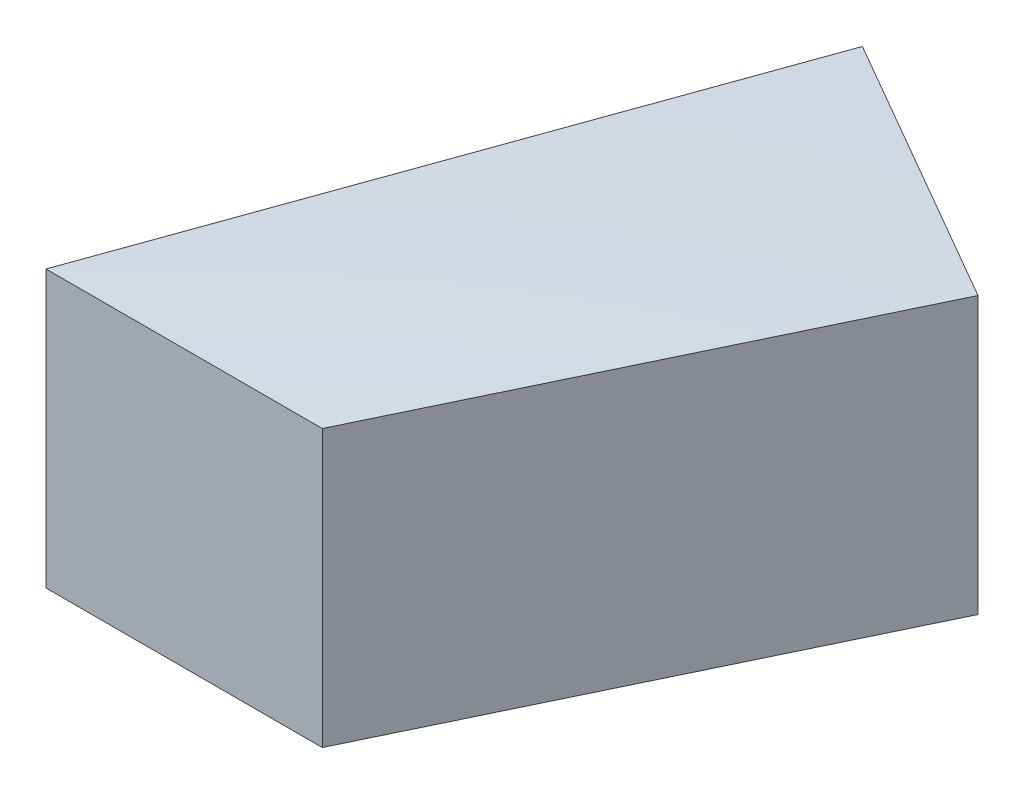
ISO-10303-21;
HEADER;
FILE_DESCRIPTION(('STEP AP214'),'2;1');
FILE_NAME('part.step','',(''),(''),'','','');
FILE_SCHEMA(('AUTOMOTIVE_DESIGN { 1 0 10303 214 1 1 1 1 }'));
ENDSEC;
DATA;
#1=APPLICATION_CONTEXT('core data for automotive mechanical design processes');
#2=APPLICATION_PROTOCOL_DEFINITION('international standard','automotive_design',2000,#1);
#3=PRODUCT_CONTEXT('',#1,'mechanical');
#4=PRODUCT('Part','Part','',(#3));
#5=PRODUCT_RELATED_PRODUCT_CATEGORY('part','',(#4));
#6=PRODUCT_DEFINITION_FORMATION('','',#4);
#7=PRODUCT_DEFINITION_CONTEXT('part definition',#1,'design');
#8=PRODUCT_DEFINITION('design','',#6,#7);
#9=PRODUCT_DEFINITION_SHAPE('','',#8);
#10=(LENGTH_UNIT() NAMED_UNIT(*) SI_UNIT(.MILLI.,.METRE.));
#11=(NAMED_UNIT(*) PLANE_ANGLE_UNIT() SI_UNIT($,.RADIAN.));
#12=(NAMED_UNIT(*) SI_UNIT($,.STERADIAN.) SOLID_ANGLE_UNIT());
#13=UNCERTAINTY_MEASURE_WITH_UNIT(LENGTH_MEASURE(1.E-05),#10,'distance_accuracy_value','');
#14=(GEOMETRIC_REPRESENTATION_CONTEXT(3) GLOBAL_UNCERTAINTY_ASSIGNED_CONTEXT((#13)) GLOBAL_UNIT_ASSIGNED_CONTEXT((#10,
#11,#12)) REPRESENTATION_CONTEXT('',''));
#15=CARTESIAN_POINT('',(0.,0.,0.));
#16=DIRECTION('',(0.,0.,1.));
#17=DIRECTION('',(1.,0.,0.));
#18=AXIS2_PLACEMENT_3D('',#15,#16,#17);
#19=CARTESIAN_POINT('',(0.,0.,0.));
#20=DIRECTION('',(0.,0.,1.));
#21=DIRECTION('',(1.,0.,0.));
#22=AXIS2_PLACEMENT_3D('',#19,#20,#21);
#23=PLANE('',#22);
#24=DIRECTION('',(0.,1.,0.));
#25=VECTOR('',#24,1.);
#26=CARTESIAN_POINT('',(350.,350.,0.));
#27=LINE('',#26,#25);
#28=CARTESIAN_POINT('',(350.,-350.,0.));
#29=VERTEX_POINT('',#28);
#30=CARTESIAN_POINT('',(350.,350.,0.));
#31=VERTEX_POINT('',#30);
#32=EDGE_CURVE('E181',#29,#31,#27,.T.);
#33=ORIENTED_EDGE('',*,*,#32,.T.);
#34=DIRECTION('',(-1.,0.,0.));
#35=VECTOR('',#34,1.);
#36=CARTESIAN_POINT('',(-350.,350.,0.));
#37=LINE('',#36,#35);
#38=CARTESIAN_POINT('',(-350.,350.,0.));
#39=VERTEX_POINT('',#38);
#40=EDGE_CURVE('E89',#31,#39,#37,.T.);
#41=ORIENTED_EDGE('',*,*,#40,.T.);
#42=DIRECTION('',(0.,-1.,0.));
#43=VECTOR('',#42,1.);
#44=CARTESIAN_POINT('',(-350.,350.,0.));
#45=LINE('',#44,#43);
#46=CARTESIAN_POINT('',(-350.,-350.,0.));
#47=VERTEX_POINT('',#46);
#48=EDGE_CURVE('E126',#39,#47,#45,.T.);
#49=ORIENTED_EDGE('',*,*,#48,.T.);
#50=DIRECTION('',(1.,0.,0.));
#51=VECTOR('',#50,1.);
#52=CARTESIAN_POINT('',(-350.,-350.,0.));
#53=LINE('',#52,#51);
#54=EDGE_CURVE('E170',#47,#29,#53,.T.);
#55=ORIENTED_EDGE('',*,*,#54,.T.);
#56=EDGE_LOOP('',(#33,#41,#49,#55));
#57=FACE_BOUND('',#56,.T.);
#58=ADVANCED_FACE('F53',(#57),#23,.T.);
#59=CARTESIAN_POINT('',(662.500000000001,0.,-1147.48366001438));
#60=DIRECTION('',(0.500000000000001,0.,-0.866025403784438));
#61=DIRECTION('',(-0.866025403784438,0.,-0.500000000000001));
#62=AXIS2_PLACEMENT_3D('',#59,#60,#61);
#63=PLANE('',#62);
#64=DIRECTION('',(-0.866025403784438,0.,-0.500000000000001));
#65=VECTOR('',#64,1.);
#66=CARTESIAN_POINT('',(1138.81397208144,600.,-872.48366001438));
#67=LINE('',#66,#65);
#68=CARTESIAN_POINT('',(1138.81397208144,600.,-872.48366001438));
#69=VERTEX_POINT('',#68);
#70=CARTESIAN_POINT('',(445.993649053891,600.,-1272.48366001438));
#71=VERTEX_POINT('',#70);
#72=EDGE_CURVE('E107',#69,#71,#67,.T.);
#73=ORIENTED_EDGE('',*,*,#72,.F.);
#74=DIRECTION('',(0.,1.,0.));
#75=VECTOR('',#74,1.);
#76=CARTESIAN_POINT('',(1138.81397208144,-99.9999999999999,-872.483660014379));
#77=LINE('',#76,#75);
#78=CARTESIAN_POINT('',(1138.81397208144,-99.9999999999999,-872.483660014379));
#79=VERTEX_POINT('',#78);
#80=EDGE_CURVE('E13',#79,#69,#77,.T.);
#81=ORIENTED_EDGE('',*,*,#80,.F.);
#82=DIRECTION('',(0.866025403784438,0.,0.500000000000001));
#83=VECTOR('',#82,1.);
#84=CARTESIAN_POINT('',(1138.81397208144,-99.9999999999999,-872.483660014379));
#85=LINE('',#84,#83);
#86=CARTESIAN_POINT('',(445.993649053892,-100.,-1272.48366001438));
#87=VERTEX_POINT('',#86);
#88=EDGE_CURVE('E64',#87,#79,#85,.T.);
#89=ORIENTED_EDGE('',*,*,#88,.F.);
#90=DIRECTION('',(0.,-1.,0.));
#91=VECTOR('',#90,1.);
#92=CARTESIAN_POINT('',(445.993649053892,-100.,-1272.48366001438));
#93=LINE('',#92,#91);
#94=EDGE_CURVE('E104',#71,#87,#93,.T.);
#95=ORIENTED_EDGE('',*,*,#94,.F.);
#96=EDGE_LOOP('',(#73,#81,#89,#95));
#97=FACE_BOUND('',#96,.T.);
#98=ADVANCED_FACE('F106',(#97),#63,.T.);
#99=CARTESIAN_POINT('',(445.993649053892,-100.,-1272.48366001438));
#100=CARTESIAN_POINT('',(180.662432702595,-183.333333333333,-848.322440009587));
#101=CARTESIAN_POINT('',(-84.6687836487026,-266.666666666667,-424.161220004793));
#102=CARTESIAN_POINT('',(-350.,-350.,0.));
#103=CARTESIAN_POINT('',(503.728675972854,-100.,-1239.15032668105));
#104=CARTESIAN_POINT('',(238.596895093014,-183.333333333333,-826.100217787364));
#105=CARTESIAN_POINT('',(-26.5348857868262,-266.666666666667,-413.050108893682));
#106=CARTESIAN_POINT('',(-291.666666666667,-350.,0.));
#107=CARTESIAN_POINT('',(619.19872981078,-100.,-1172.48366001438));
#108=CARTESIAN_POINT('',(354.465819873853,-183.333333333334,-781.65577334292));
#109=CARTESIAN_POINT('',(89.7329099369267,-266.666666666667,-390.82788667146));
#110=CARTESIAN_POINT('',(-175.,-350.,0.));
#111=CARTESIAN_POINT('',(792.403810567667,-100.,-1072.48366001438));
#112=CARTESIAN_POINT('',(528.269207045111,-183.333333333333,-714.989106676254));
#113=CARTESIAN_POINT('',(264.134603522556,-266.666666666667,-357.494553338127));
#114=CARTESIAN_POINT('',(0.,-350.,0.));
#115=CARTESIAN_POINT('',(965.608891324554,-100.,-972.483660014379));
#116=CARTESIAN_POINT('',(702.07259421637,-183.333333333333,-648.322440009586));
#117=CARTESIAN_POINT('',(438.536297108185,-266.666666666667,-324.161220004793));
#118=CARTESIAN_POINT('',(175.,-350.,0.));
#119=CARTESIAN_POINT('',(1081.07894516248,-100.,-905.816993347713));
#120=CARTESIAN_POINT('',(817.941518997209,-183.333333333333,-603.877995565142));
#121=CARTESIAN_POINT('',(554.804092831938,-266.666666666667,-301.938997782571));
#122=CARTESIAN_POINT('',(291.666666666667,-350.,0.));
#123=CARTESIAN_POINT('',(1138.81397208144,-99.9999999999999,-872.483660014379));
#124=CARTESIAN_POINT('',(875.875981387628,-183.333333333333,-581.65577334292));
#125=CARTESIAN_POINT('',(612.937990693814,-266.666666666667,-290.82788667146));
#126=CARTESIAN_POINT('',(350.,-350.,0.));
#127=B_SPLINE_SURFACE_WITH_KNOTS('',3,3,((#99,#100,#101,#102),(#103,#104,#105,#106),(#107,#108,
#109,#110),(#111,#112,#113,#114),(#115,#116,#117,#118),(#119,#120,#121,#122),(#123,#124,#125,
#126)),.UNSPECIFIED.,.F.,.F.,.F.,(4,1,1,1,4),(4,4),(0.659340659340659,0.744505494505495,
0.82967032967033,0.914835164835165,1.),(0.,1.),.UNSPECIFIED.);
#128=CARTESIAN_POINT('',(1138.81397208144,-99.9999999999999,-872.483660014379));
#129=CARTESIAN_POINT('',(875.875981387628,-183.333333333333,-581.65577334292));
#130=CARTESIAN_POINT('',(612.937990693814,-266.666666666667,-290.82788667146));
#131=CARTESIAN_POINT('',(350.,-350.,0.));
#132=B_SPLINE_CURVE_WITH_KNOTS('',3,(#128,#129,#130,#131),.UNSPECIFIED.,.F.,.F.,(4,4),(0.,1.),.UNSPECIFIED.);
#133=EDGE_CURVE('E121',#79,#29,#132,.T.);
#134=DIRECTION('',(-0.523123269933759,-0.16429882027185,0.836270256622277));
#135=VECTOR('',#134,1.);
#136=CARTESIAN_POINT('',(47.996824526946,-225.,-636.24183000719));
#137=LINE('',#136,#135);
#138=EDGE_CURVE('E128',#87,#47,#137,.T.);
#139=ORIENTED_EDGE('',*,*,#88,.T.);
#140=ORIENTED_EDGE('',*,*,#133,.T.);
#141=ORIENTED_EDGE('',*,*,#54,.F.);
#142=ORIENTED_EDGE('',*,*,#138,.F.);
#143=EDGE_LOOP('',(#139,#140,#141,#142));
#144=FACE_BOUND('',#143,.T.);
#145=ADVANCED_FACE('F149',(#144),#127,.T.);
#146=CARTESIAN_POINT('',(445.993649053891,600.,-1272.48366001438));
#147=DIRECTION('',(-0.847791219505554,0.,-0.530330131266635));
#148=DIRECTION('',(0.,-1.,0.));
#149=AXIS2_PLACEMENT_3D('',#146,#147,#148);
#150=PLANE('',#149);
#151=ORIENTED_EDGE('',*,*,#94,.T.);
#152=ORIENTED_EDGE('',*,*,#138,.T.);
#153=ORIENTED_EDGE('',*,*,#48,.F.);
#154=DIRECTION('',(-0.523123269933759,-0.164298820271851,0.836270256622277));
#155=VECTOR('',#154,1.);
#156=CARTESIAN_POINT('',(47.9968245269457,475.,-636.24183000719));
#157=LINE('',#156,#155);
#158=EDGE_CURVE('E120',#71,#39,#157,.T.);
#159=ORIENTED_EDGE('',*,*,#158,.F.);
#160=EDGE_LOOP('',(#151,#152,#153,#159));
#161=FACE_BOUND('',#160,.T.);
#162=ADVANCED_FACE('F125',(#161),#150,.T.);
#163=CARTESIAN_POINT('',(1138.81397208144,600.,-872.48366001438));
#164=CARTESIAN_POINT('',(875.875981387628,516.666666666667,-581.65577334292));
#165=CARTESIAN_POINT('',(612.937990693814,433.333333333333,-290.82788667146));
#166=CARTESIAN_POINT('',(350.,350.,0.));
#167=CARTESIAN_POINT('',(1081.07894516248,600.,-905.816993347713));
#168=CARTESIAN_POINT('',(817.941518997209,516.666666666667,-603.877995565142));
#169=CARTESIAN_POINT('',(554.804092831938,433.333333333333,-301.938997782571));
#170=CARTESIAN_POINT('',(291.666666666667,350.,0.));
#171=CARTESIAN_POINT('',(965.608891324555,600.,-972.483660014381));
#172=CARTESIAN_POINT('',(702.07259421637,516.666666666666,-648.322440009587));
#173=CARTESIAN_POINT('',(438.536297108185,433.333333333333,-324.161220004794));
#174=CARTESIAN_POINT('',(175.,350.,0.));
#175=CARTESIAN_POINT('',(792.403810567666,600.000000000001,-1072.48366001438));
#176=CARTESIAN_POINT('',(528.269207045111,516.666666666668,-714.989106676253));
#177=CARTESIAN_POINT('',(264.134603522555,433.333333333334,-357.494553338127));
#178=CARTESIAN_POINT('',(0.,350.,0.));
#179=CARTESIAN_POINT('',(619.19872981078,599.999999999999,-1172.48366001438));
#180=CARTESIAN_POINT('',(354.465819873853,516.666666666666,-781.655773342921));
#181=CARTESIAN_POINT('',(89.7329099369265,433.333333333333,-390.82788667146));
#182=CARTESIAN_POINT('',(-175.,350.,0.));
#183=CARTESIAN_POINT('',(503.728675972854,600.,-1239.15032668105));
#184=CARTESIAN_POINT('',(238.596895093014,516.666666666667,-826.100217787365));
#185=CARTESIAN_POINT('',(-26.5348857868265,433.333333333333,-413.050108893682));
#186=CARTESIAN_POINT('',(-291.666666666667,350.,0.));
#187=CARTESIAN_POINT('',(445.993649053891,600.,-1272.48366001438));
#188=CARTESIAN_POINT('',(180.662432702594,516.666666666667,-848.322440009587));
#189=CARTESIAN_POINT('',(-84.6687836487028,433.333333333333,-424.161220004794));
#190=CARTESIAN_POINT('',(-350.,350.,0.));
#191=B_SPLINE_SURFACE_WITH_KNOTS('',3,3,((#163,#164,#165,#166),(#167,#168,#169,#170),(#171,#172,
#173,#174),(#175,#176,#177,#178),(#179,#180,#181,#182),(#183,#184,#185,#186),(#187,#188,#189,
#190)),.UNSPECIFIED.,.F.,.F.,.F.,(4,1,1,1,4),(4,4),(0.,0.0851648351648352,0.17032967032967,
0.255494505494505,0.340659340659341),(0.,1.),.UNSPECIFIED.);
#192=CARTESIAN_POINT('',(350.,350.,0.));
#193=CARTESIAN_POINT('',(612.937990693814,433.333333333333,-290.82788667146));
#194=CARTESIAN_POINT('',(875.875981387628,516.666666666667,-581.65577334292));
#195=CARTESIAN_POINT('',(1138.81397208144,600.,-872.48366001438));
#196=B_SPLINE_CURVE_WITH_KNOTS('',3,(#192,#193,#194,#195),.UNSPECIFIED.,.F.,.F.,(4,4),(0.,1.),.UNSPECIFIED.);
#197=EDGE_CURVE('E73',#69,#31,#196,.F.);
#198=ORIENTED_EDGE('',*,*,#72,.T.);
#199=ORIENTED_EDGE('',*,*,#158,.T.);
#200=ORIENTED_EDGE('',*,*,#40,.F.);
#201=ORIENTED_EDGE('',*,*,#197,.F.);
#202=EDGE_LOOP('',(#198,#199,#200,#201));
#203=FACE_BOUND('',#202,.T.);
#204=ADVANCED_FACE('F119',(#203),#191,.T.);
#205=CARTESIAN_POINT('',(192.582820306423,0.,174.114457843317));
#206=DIRECTION('',(-0.741779367094369,0.,-0.670643996881413));
#207=DIRECTION('',(-0.670643996881413,0.,0.741779367094369));
#208=AXIS2_PLACEMENT_3D('',#205,#206,#207);
#209=PLANE('',#208);
#210=ORIENTED_EDGE('',*,*,#197,.T.);
#211=ORIENTED_EDGE('',*,*,#32,.F.);
#212=ORIENTED_EDGE('',*,*,#133,.F.);
#213=ORIENTED_EDGE('',*,*,#80,.T.);
#214=EDGE_LOOP('',(#210,#211,#212,#213));
#215=FACE_BOUND('',#214,.T.);
#216=ADVANCED_FACE('F153',(#215),#209,.F.);
#217=CLOSED_SHELL('',(#58,#98,#145,#162,#204,#216));
#218=MANIFOLD_SOLID_BREP('B2',#217);
#219=ADVANCED_BREP_SHAPE_REPRESENTATION('',(#18,#218),#14);
#220=SHAPE_DEFINITION_REPRESENTATION(#9,#219);
ENDSEC;
END-ISO-10303-21;
